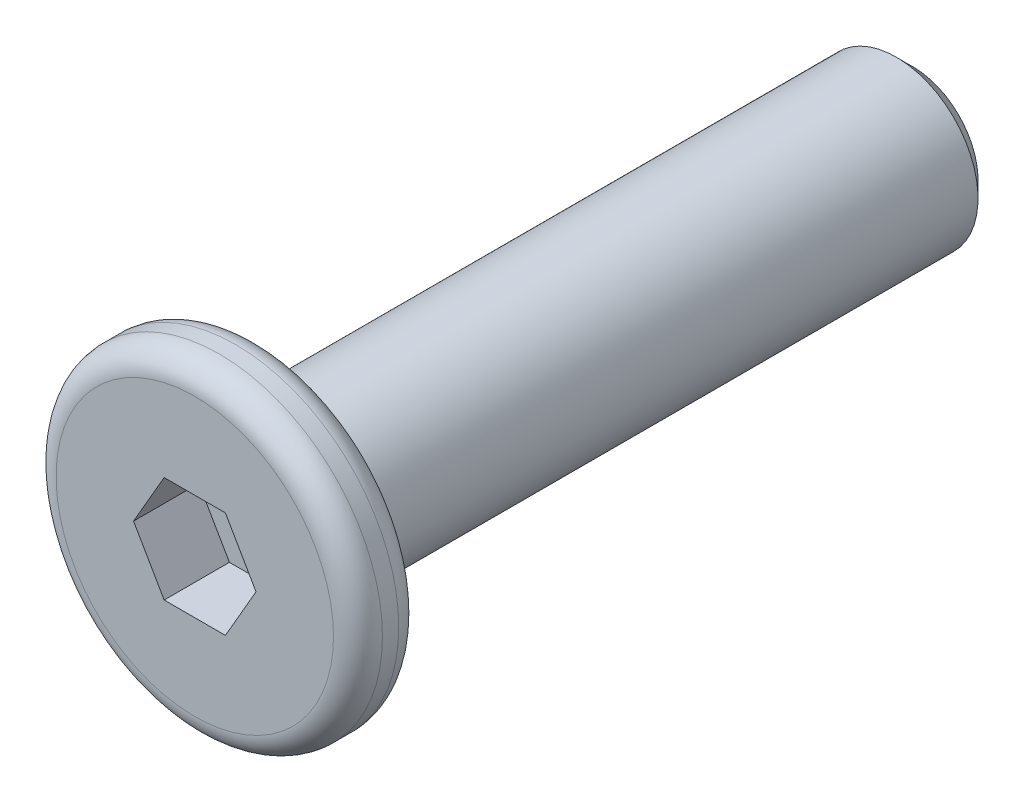
ISO-10303-21;
HEADER;
FILE_DESCRIPTION(('STEP AP214'),'2;1');
FILE_NAME('part.step','',(''),(''),'','','');
FILE_SCHEMA(('AUTOMOTIVE_DESIGN { 1 0 10303 214 1 1 1 1 }'));
ENDSEC;
DATA;
#1=APPLICATION_CONTEXT('core data for automotive mechanical design processes');
#2=APPLICATION_PROTOCOL_DEFINITION('international standard','automotive_design',2000,#1);
#3=PRODUCT_CONTEXT('',#1,'mechanical');
#4=PRODUCT('Part','Part','',(#3));
#5=PRODUCT_RELATED_PRODUCT_CATEGORY('part','',(#4));
#6=PRODUCT_DEFINITION_FORMATION('','',#4);
#7=PRODUCT_DEFINITION_CONTEXT('part definition',#1,'design');
#8=PRODUCT_DEFINITION('design','',#6,#7);
#9=PRODUCT_DEFINITION_SHAPE('','',#8);
#10=(LENGTH_UNIT() NAMED_UNIT(*) SI_UNIT(.MILLI.,.METRE.));
#11=(NAMED_UNIT(*) PLANE_ANGLE_UNIT() SI_UNIT($,.RADIAN.));
#12=(NAMED_UNIT(*) SI_UNIT($,.STERADIAN.) SOLID_ANGLE_UNIT());
#13=UNCERTAINTY_MEASURE_WITH_UNIT(LENGTH_MEASURE(1.E-05),#10,'distance_accuracy_value','');
#14=(GEOMETRIC_REPRESENTATION_CONTEXT(3) GLOBAL_UNCERTAINTY_ASSIGNED_CONTEXT((#13)) GLOBAL_UNIT_ASSIGNED_CONTEXT((#10,
#11,#12)) REPRESENTATION_CONTEXT('',''));
#15=CARTESIAN_POINT('',(0.,0.,0.));
#16=DIRECTION('',(0.,0.,1.));
#17=DIRECTION('',(1.,0.,0.));
#18=AXIS2_PLACEMENT_3D('',#15,#16,#17);
#19=CARTESIAN_POINT('',(0.,0.,0.4));
#20=DIRECTION('',(0.,0.,-1.));
#21=DIRECTION('',(-1.,0.,0.));
#22=AXIS2_PLACEMENT_3D('',#19,#20,#21);
#23=CYLINDRICAL_SURFACE('',#22,2.);
#24=CARTESIAN_POINT('',(0.,0.,-0.1));
#25=DIRECTION('',(0.,0.,1.));
#26=DIRECTION('',(1.,0.,0.));
#27=AXIS2_PLACEMENT_3D('',#24,#25,#26);
#28=CIRCLE('',#27,2.);
#29=CARTESIAN_POINT('',(2.,0.,-0.1));
#30=VERTEX_POINT('',#29);
#31=EDGE_CURVE('E153',#30,#30,#28,.T.);
#32=ORIENTED_EDGE('',*,*,#31,.T.);
#33=EDGE_LOOP('',(#32));
#34=FACE_BOUND('',#33,.T.);
#35=CARTESIAN_POINT('',(0.,0.,0.1));
#36=DIRECTION('',(0.,0.,1.));
#37=DIRECTION('',(1.,0.,0.));
#38=AXIS2_PLACEMENT_3D('',#35,#36,#37);
#39=CIRCLE('',#38,2.);
#40=CARTESIAN_POINT('',(2.,0.,0.1));
#41=VERTEX_POINT('',#40);
#42=EDGE_CURVE('E150',#41,#41,#39,.F.);
#43=ORIENTED_EDGE('',*,*,#42,.T.);
#44=EDGE_LOOP('',(#43));
#45=FACE_BOUND('',#44,.T.);
#46=ADVANCED_FACE('F34',(#34,#45),#23,.T.);
#47=CARTESIAN_POINT('',(0.,0.,0.4));
#48=DIRECTION('',(0.,0.,1.));
#49=DIRECTION('',(1.,0.,0.));
#50=AXIS2_PLACEMENT_3D('',#47,#48,#49);
#51=PLANE('',#50);
#52=CARTESIAN_POINT('',(0.,0.,0.4));
#53=DIRECTION('',(0.,0.,1.));
#54=DIRECTION('',(1.,0.,0.));
#55=AXIS2_PLACEMENT_3D('',#52,#53,#54);
#56=CIRCLE('',#55,1.7);
#57=CARTESIAN_POINT('',(1.7,0.,0.4));
#58=VERTEX_POINT('',#57);
#59=EDGE_CURVE('E11',#58,#58,#56,.T.);
#60=ORIENTED_EDGE('',*,*,#59,.T.);
#61=EDGE_LOOP('',(#60));
#62=FACE_BOUND('',#61,.T.);
#63=DIRECTION('',(0.5,0.866025403784439,0.));
#64=VECTOR('',#63,1.);
#65=CARTESIAN_POINT('',(0.375277674973257,-0.65,0.4));
#66=LINE('',#65,#64);
#67=CARTESIAN_POINT('',(0.375277674973257,-0.65,0.4));
#68=VERTEX_POINT('',#67);
#69=CARTESIAN_POINT('',(0.750555349946514,0.,0.4));
#70=VERTEX_POINT('',#69);
#71=EDGE_CURVE('E49',#68,#70,#66,.T.);
#72=ORIENTED_EDGE('',*,*,#71,.F.);
#73=DIRECTION('',(1.,0.,0.));
#74=VECTOR('',#73,1.);
#75=CARTESIAN_POINT('',(-0.375277674973256,-0.65,0.4));
#76=LINE('',#75,#74);
#77=CARTESIAN_POINT('',(-0.375277674973256,-0.65,0.4));
#78=VERTEX_POINT('',#77);
#79=EDGE_CURVE('E132',#78,#68,#76,.T.);
#80=ORIENTED_EDGE('',*,*,#79,.F.);
#81=DIRECTION('',(0.5,-0.866025403784438,0.));
#82=VECTOR('',#81,1.);
#83=CARTESIAN_POINT('',(-0.750555349946513,0.,0.4));
#84=LINE('',#83,#82);
#85=CARTESIAN_POINT('',(-0.750555349946513,0.,0.4));
#86=VERTEX_POINT('',#85);
#87=EDGE_CURVE('E130',#86,#78,#84,.T.);
#88=ORIENTED_EDGE('',*,*,#87,.F.);
#89=DIRECTION('',(-0.5,-0.866025403784439,0.));
#90=VECTOR('',#89,1.);
#91=CARTESIAN_POINT('',(-0.375277674973257,0.65,0.4));
#92=LINE('',#91,#90);
#93=CARTESIAN_POINT('',(-0.375277674973257,0.65,0.4));
#94=VERTEX_POINT('',#93);
#95=EDGE_CURVE('E97',#94,#86,#92,.T.);
#96=ORIENTED_EDGE('',*,*,#95,.F.);
#97=DIRECTION('',(-1.,0.,0.));
#98=VECTOR('',#97,1.);
#99=CARTESIAN_POINT('',(0.375277674973257,0.65,0.4));
#100=LINE('',#99,#98);
#101=CARTESIAN_POINT('',(0.375277674973257,0.65,0.4));
#102=VERTEX_POINT('',#101);
#103=EDGE_CURVE('E126',#102,#94,#100,.T.);
#104=ORIENTED_EDGE('',*,*,#103,.F.);
#105=DIRECTION('',(-0.5,0.866025403784439,0.));
#106=VECTOR('',#105,1.);
#107=CARTESIAN_POINT('',(0.750555349946514,0.,0.4));
#108=LINE('',#107,#106);
#109=EDGE_CURVE('E123',#70,#102,#108,.T.);
#110=ORIENTED_EDGE('',*,*,#109,.F.);
#111=EDGE_LOOP('',(#72,#80,#88,#96,#104,#110));
#112=FACE_BOUND('',#111,.T.);
#113=ADVANCED_FACE('F168',(#62,#112),#51,.T.);
#114=CARTESIAN_POINT('',(0.,0.,-0.4));
#115=DIRECTION('',(0.,0.,1.));
#116=DIRECTION('',(1.,0.,0.));
#117=AXIS2_PLACEMENT_3D('',#114,#115,#116);
#118=PLANE('',#117);
#119=CARTESIAN_POINT('',(0.,0.,-0.4));
#120=DIRECTION('',(0.,0.,1.));
#121=DIRECTION('',(1.,0.,0.));
#122=AXIS2_PLACEMENT_3D('',#119,#120,#121);
#123=CIRCLE('',#122,1.7);
#124=CARTESIAN_POINT('',(1.7,0.,-0.4));
#125=VERTEX_POINT('',#124);
#126=EDGE_CURVE('E42',#125,#125,#123,.F.);
#127=ORIENTED_EDGE('',*,*,#126,.T.);
#128=EDGE_LOOP('',(#127));
#129=FACE_BOUND('',#128,.T.);
#130=CARTESIAN_POINT('',(0.,0.,-0.4));
#131=DIRECTION('',(0.,0.,-1.));
#132=DIRECTION('',(-1.,0.,0.));
#133=AXIS2_PLACEMENT_3D('',#130,#131,#132);
#134=CIRCLE('',#133,1.);
#135=CARTESIAN_POINT('',(-1.,0.,-0.4));
#136=VERTEX_POINT('',#135);
#137=EDGE_CURVE('E136',#136,#136,#134,.T.);
#138=ORIENTED_EDGE('',*,*,#137,.F.);
#139=EDGE_LOOP('',(#138));
#140=FACE_BOUND('',#139,.T.);
#141=ADVANCED_FACE('F158',(#129,#140),#118,.F.);
#142=CARTESIAN_POINT('',(0.,0.,-8.4));
#143=DIRECTION('',(0.,0.,1.));
#144=DIRECTION('',(1.,0.,0.));
#145=AXIS2_PLACEMENT_3D('',#142,#143,#144);
#146=CYLINDRICAL_SURFACE('',#145,1.);
#147=CARTESIAN_POINT('',(0.,0.,-8.2));
#148=DIRECTION('',(0.,0.,-1.));
#149=DIRECTION('',(-1.,0.,0.));
#150=AXIS2_PLACEMENT_3D('',#147,#148,#149);
#151=CIRCLE('',#150,1.);
#152=CARTESIAN_POINT('',(-1.,0.,-8.2));
#153=VERTEX_POINT('',#152);
#154=EDGE_CURVE('E147',#153,#153,#151,.F.);
#155=ORIENTED_EDGE('',*,*,#154,.T.);
#156=EDGE_LOOP('',(#155));
#157=FACE_BOUND('',#156,.T.);
#158=ORIENTED_EDGE('',*,*,#137,.T.);
#159=EDGE_LOOP('',(#158));
#160=FACE_BOUND('',#159,.T.);
#161=ADVANCED_FACE('F203',(#157,#160),#146,.T.);
#162=CARTESIAN_POINT('',(0.,0.,-8.4));
#163=DIRECTION('',(0.,0.,-1.));
#164=DIRECTION('',(-1.,0.,0.));
#165=AXIS2_PLACEMENT_3D('',#162,#163,#164);
#166=PLANE('',#165);
#167=CARTESIAN_POINT('',(0.,0.,-8.4));
#168=DIRECTION('',(0.,0.,-1.));
#169=DIRECTION('',(-1.,0.,0.));
#170=AXIS2_PLACEMENT_3D('',#167,#168,#169);
#171=CIRCLE('',#170,0.8);
#172=CARTESIAN_POINT('',(-0.8,0.,-8.4));
#173=VERTEX_POINT('',#172);
#174=EDGE_CURVE('E144',#173,#173,#171,.T.);
#175=ORIENTED_EDGE('',*,*,#174,.T.);
#176=EDGE_LOOP('',(#175));
#177=FACE_BOUND('',#176,.T.);
#178=ADVANCED_FACE('F195',(#177),#166,.T.);
#179=CARTESIAN_POINT('',(0.,0.,-8.4));
#180=DIRECTION('',(0.,0.,1.));
#181=DIRECTION('',(1.,0.,0.));
#182=AXIS2_PLACEMENT_3D('',#179,#180,#181);
#183=CONICAL_SURFACE('',#182,0.8,0.78539816339745);
#184=ORIENTED_EDGE('',*,*,#154,.F.);
#185=EDGE_LOOP('',(#184));
#186=FACE_BOUND('',#185,.T.);
#187=ORIENTED_EDGE('',*,*,#174,.F.);
#188=EDGE_LOOP('',(#187));
#189=FACE_BOUND('',#188,.T.);
#190=ADVANCED_FACE('F188',(#186,#189),#183,.T.);
#191=CARTESIAN_POINT('',(0.375277674973257,-0.65,-0.4));
#192=DIRECTION('',(0.866025403784439,-0.5,0.));
#193=DIRECTION('',(0.5,0.866025403784439,0.));
#194=AXIS2_PLACEMENT_3D('',#191,#192,#193);
#195=PLANE('',#194);
#196=ORIENTED_EDGE('',*,*,#71,.T.);
#197=DIRECTION('',(0.,0.,1.));
#198=VECTOR('',#197,1.);
#199=CARTESIAN_POINT('',(0.750555349946514,0.,-0.4));
#200=LINE('',#199,#198);
#201=CARTESIAN_POINT('',(0.750555349946514,0.,-0.4));
#202=VERTEX_POINT('',#201);
#203=EDGE_CURVE('E79',#202,#70,#200,.T.);
#204=ORIENTED_EDGE('',*,*,#203,.F.);
#205=DIRECTION('',(0.5,0.866025403784439,0.));
#206=VECTOR('',#205,1.);
#207=CARTESIAN_POINT('',(0.375277674973257,-0.65,-0.4));
#208=LINE('',#207,#206);
#209=CARTESIAN_POINT('',(0.375277674973257,-0.65,-0.4));
#210=VERTEX_POINT('',#209);
#211=EDGE_CURVE('E134',#210,#202,#208,.T.);
#212=ORIENTED_EDGE('',*,*,#211,.F.);
#213=DIRECTION('',(0.,0.,1.));
#214=VECTOR('',#213,1.);
#215=CARTESIAN_POINT('',(0.375277674973257,-0.65,-0.4));
#216=LINE('',#215,#214);
#217=EDGE_CURVE('E57',#210,#68,#216,.T.);
#218=ORIENTED_EDGE('',*,*,#217,.T.);
#219=EDGE_LOOP('',(#196,#204,#212,#218));
#220=FACE_BOUND('',#219,.T.);
#221=ADVANCED_FACE('F185',(#220),#195,.F.);
#222=CARTESIAN_POINT('',(-0.375277674973256,-0.65,-0.4));
#223=DIRECTION('',(0.,-1.,0.));
#224=DIRECTION('',(1.,0.,0.));
#225=AXIS2_PLACEMENT_3D('',#222,#223,#224);
#226=PLANE('',#225);
#227=ORIENTED_EDGE('',*,*,#79,.T.);
#228=ORIENTED_EDGE('',*,*,#217,.F.);
#229=DIRECTION('',(1.,0.,0.));
#230=VECTOR('',#229,1.);
#231=CARTESIAN_POINT('',(-0.375277674973256,-0.65,-0.4));
#232=LINE('',#231,#230);
#233=CARTESIAN_POINT('',(-0.375277674973256,-0.65,-0.4));
#234=VERTEX_POINT('',#233);
#235=EDGE_CURVE('E109',#234,#210,#232,.T.);
#236=ORIENTED_EDGE('',*,*,#235,.F.);
#237=DIRECTION('',(0.,0.,1.));
#238=VECTOR('',#237,1.);
#239=CARTESIAN_POINT('',(-0.375277674973256,-0.65,-0.4));
#240=LINE('',#239,#238);
#241=EDGE_CURVE('E101',#234,#78,#240,.T.);
#242=ORIENTED_EDGE('',*,*,#241,.T.);
#243=EDGE_LOOP('',(#227,#228,#236,#242));
#244=FACE_BOUND('',#243,.T.);
#245=ADVANCED_FACE('F187',(#244),#226,.F.);
#246=CARTESIAN_POINT('',(-0.750555349946513,0.,-0.4));
#247=DIRECTION('',(-0.866025403784438,-0.5,0.));
#248=DIRECTION('',(0.5,-0.866025403784439,0.));
#249=AXIS2_PLACEMENT_3D('',#246,#247,#248);
#250=PLANE('',#249);
#251=ORIENTED_EDGE('',*,*,#87,.T.);
#252=ORIENTED_EDGE('',*,*,#241,.F.);
#253=DIRECTION('',(0.5,-0.866025403784438,0.));
#254=VECTOR('',#253,1.);
#255=CARTESIAN_POINT('',(-0.750555349946513,0.,-0.4));
#256=LINE('',#255,#254);
#257=CARTESIAN_POINT('',(-0.750555349946513,0.,-0.4));
#258=VERTEX_POINT('',#257);
#259=EDGE_CURVE('E105',#258,#234,#256,.T.);
#260=ORIENTED_EDGE('',*,*,#259,.F.);
#261=DIRECTION('',(0.,0.,1.));
#262=VECTOR('',#261,1.);
#263=CARTESIAN_POINT('',(-0.750555349946513,0.,-0.4));
#264=LINE('',#263,#262);
#265=EDGE_CURVE('E90',#258,#86,#264,.T.);
#266=ORIENTED_EDGE('',*,*,#265,.T.);
#267=EDGE_LOOP('',(#251,#252,#260,#266));
#268=FACE_BOUND('',#267,.T.);
#269=ADVANCED_FACE('F106',(#268),#250,.F.);
#270=CARTESIAN_POINT('',(-0.375277674973257,0.65,-0.4));
#271=DIRECTION('',(-0.866025403784439,0.5,0.));
#272=DIRECTION('',(-0.5,-0.866025403784439,0.));
#273=AXIS2_PLACEMENT_3D('',#270,#271,#272);
#274=PLANE('',#273);
#275=ORIENTED_EDGE('',*,*,#95,.T.);
#276=ORIENTED_EDGE('',*,*,#265,.F.);
#277=DIRECTION('',(-0.5,-0.866025403784439,0.));
#278=VECTOR('',#277,1.);
#279=CARTESIAN_POINT('',(-0.375277674973257,0.65,-0.4));
#280=LINE('',#279,#278);
#281=CARTESIAN_POINT('',(-0.375277674973257,0.65,-0.4));
#282=VERTEX_POINT('',#281);
#283=EDGE_CURVE('E94',#282,#258,#280,.T.);
#284=ORIENTED_EDGE('',*,*,#283,.F.);
#285=DIRECTION('',(0.,0.,1.));
#286=VECTOR('',#285,1.);
#287=CARTESIAN_POINT('',(-0.375277674973257,0.65,-0.4));
#288=LINE('',#287,#286);
#289=EDGE_CURVE('E102',#282,#94,#288,.T.);
#290=ORIENTED_EDGE('',*,*,#289,.T.);
#291=EDGE_LOOP('',(#275,#276,#284,#290));
#292=FACE_BOUND('',#291,.T.);
#293=ADVANCED_FACE('F92',(#292),#274,.F.);
#294=CARTESIAN_POINT('',(0.375277674973257,0.65,-0.4));
#295=DIRECTION('',(0.,1.,0.));
#296=DIRECTION('',(0.,0.,1.));
#297=AXIS2_PLACEMENT_3D('',#294,#295,#296);
#298=PLANE('',#297);
#299=ORIENTED_EDGE('',*,*,#103,.T.);
#300=ORIENTED_EDGE('',*,*,#289,.F.);
#301=DIRECTION('',(-1.,0.,0.));
#302=VECTOR('',#301,1.);
#303=CARTESIAN_POINT('',(0.375277674973257,0.65,-0.4));
#304=LINE('',#303,#302);
#305=CARTESIAN_POINT('',(0.375277674973257,0.65,-0.4));
#306=VERTEX_POINT('',#305);
#307=EDGE_CURVE('E115',#306,#282,#304,.T.);
#308=ORIENTED_EDGE('',*,*,#307,.F.);
#309=DIRECTION('',(0.,0.,1.));
#310=VECTOR('',#309,1.);
#311=CARTESIAN_POINT('',(0.375277674973257,0.65,-0.4));
#312=LINE('',#311,#310);
#313=EDGE_CURVE('E139',#306,#102,#312,.T.);
#314=ORIENTED_EDGE('',*,*,#313,.T.);
#315=EDGE_LOOP('',(#299,#300,#308,#314));
#316=FACE_BOUND('',#315,.T.);
#317=ADVANCED_FACE('F256',(#316),#298,.F.);
#318=CARTESIAN_POINT('',(0.750555349946514,0.,-0.4));
#319=DIRECTION('',(0.866025403784439,0.5,0.));
#320=DIRECTION('',(-0.5,0.866025403784439,0.));
#321=AXIS2_PLACEMENT_3D('',#318,#319,#320);
#322=PLANE('',#321);
#323=ORIENTED_EDGE('',*,*,#109,.T.);
#324=ORIENTED_EDGE('',*,*,#313,.F.);
#325=DIRECTION('',(-0.5,0.866025403784439,0.));
#326=VECTOR('',#325,1.);
#327=CARTESIAN_POINT('',(0.750555349946514,0.,-0.4));
#328=LINE('',#327,#326);
#329=EDGE_CURVE('E117',#202,#306,#328,.T.);
#330=ORIENTED_EDGE('',*,*,#329,.F.);
#331=ORIENTED_EDGE('',*,*,#203,.T.);
#332=EDGE_LOOP('',(#323,#324,#330,#331));
#333=FACE_BOUND('',#332,.T.);
#334=ADVANCED_FACE('F183',(#333),#322,.F.);
#335=CARTESIAN_POINT('',(0.,0.,-0.4));
#336=DIRECTION('',(0.,0.,1.));
#337=DIRECTION('',(1.,0.,0.));
#338=AXIS2_PLACEMENT_3D('',#335,#336,#337);
#339=PLANE('',#338);
#340=ORIENTED_EDGE('',*,*,#211,.T.);
#341=ORIENTED_EDGE('',*,*,#329,.T.);
#342=ORIENTED_EDGE('',*,*,#307,.T.);
#343=ORIENTED_EDGE('',*,*,#283,.T.);
#344=ORIENTED_EDGE('',*,*,#259,.T.);
#345=ORIENTED_EDGE('',*,*,#235,.T.);
#346=EDGE_LOOP('',(#340,#341,#342,#343,#344,#345));
#347=FACE_BOUND('',#346,.T.);
#348=ADVANCED_FACE('F112',(#347),#339,.T.);
#349=CARTESIAN_POINT('',(0.,0.,-0.1));
#350=DIRECTION('',(0.,0.,1.));
#351=DIRECTION('',(1.,0.,0.));
#352=AXIS2_PLACEMENT_3D('',#349,#350,#351);
#353=TOROIDAL_SURFACE('',#352,1.7,0.3);
#354=ORIENTED_EDGE('',*,*,#126,.F.);
#355=EDGE_LOOP('',(#354));
#356=FACE_BOUND('',#355,.T.);
#357=ORIENTED_EDGE('',*,*,#31,.F.);
#358=EDGE_LOOP('',(#357));
#359=FACE_BOUND('',#358,.T.);
#360=ADVANCED_FACE('F161',(#356,#359),#353,.T.);
#361=CARTESIAN_POINT('',(0.,0.,0.1));
#362=DIRECTION('',(0.,0.,1.));
#363=DIRECTION('',(1.,0.,0.));
#364=AXIS2_PLACEMENT_3D('',#361,#362,#363);
#365=TOROIDAL_SURFACE('',#364,1.7,0.3);
#366=ORIENTED_EDGE('',*,*,#42,.F.);
#367=EDGE_LOOP('',(#366));
#368=FACE_BOUND('',#367,.T.);
#369=ORIENTED_EDGE('',*,*,#59,.F.);
#370=EDGE_LOOP('',(#369));
#371=FACE_BOUND('',#370,.T.);
#372=ADVANCED_FACE('F36',(#368,#371),#365,.T.);
#373=CLOSED_SHELL('',(#46,#113,#141,#161,#178,#190,#221,#245,#269,#293,#317,#334,#348,#360,#372));
#374=MANIFOLD_SOLID_BREP('B2',#373);
#375=ADVANCED_BREP_SHAPE_REPRESENTATION('',(#18,#374),#14);
#376=SHAPE_DEFINITION_REPRESENTATION(#9,#375);
ENDSEC;
END-ISO-10303-21;
